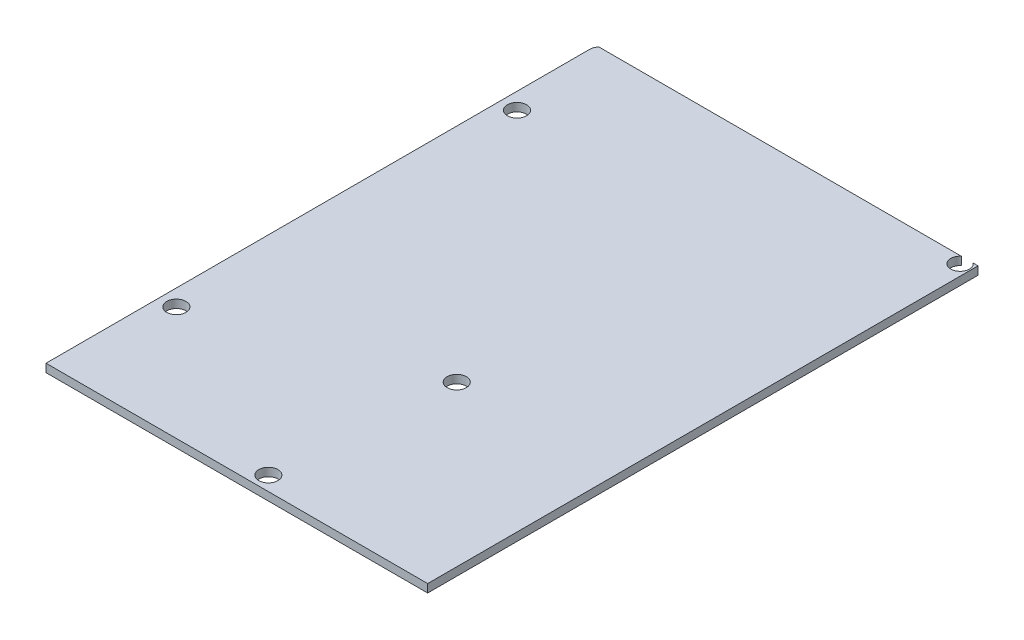
ISO-10303-21;
HEADER;
FILE_DESCRIPTION(('STEP AP214'),'2;1');
FILE_NAME('part.step','',(''),(''),'','','');
FILE_SCHEMA(('AUTOMOTIVE_DESIGN { 1 0 10303 214 1 1 1 1 }'));
ENDSEC;
DATA;
#1=APPLICATION_CONTEXT('core data for automotive mechanical design processes');
#2=APPLICATION_PROTOCOL_DEFINITION('international standard','automotive_design',2000,#1);
#3=PRODUCT_CONTEXT('',#1,'mechanical');
#4=PRODUCT('Part','Part','',(#3));
#5=PRODUCT_RELATED_PRODUCT_CATEGORY('part','',(#4));
#6=PRODUCT_DEFINITION_FORMATION('','',#4);
#7=PRODUCT_DEFINITION_CONTEXT('part definition',#1,'design');
#8=PRODUCT_DEFINITION('design','',#6,#7);
#9=PRODUCT_DEFINITION_SHAPE('','',#8);
#10=(LENGTH_UNIT() NAMED_UNIT(*) SI_UNIT(.MILLI.,.METRE.));
#11=(NAMED_UNIT(*) PLANE_ANGLE_UNIT() SI_UNIT($,.RADIAN.));
#12=(NAMED_UNIT(*) SI_UNIT($,.STERADIAN.) SOLID_ANGLE_UNIT());
#13=UNCERTAINTY_MEASURE_WITH_UNIT(LENGTH_MEASURE(1.E-05),#10,'distance_accuracy_value','');
#14=(GEOMETRIC_REPRESENTATION_CONTEXT(3) GLOBAL_UNCERTAINTY_ASSIGNED_CONTEXT((#13)) GLOBAL_UNIT_ASSIGNED_CONTEXT((#10,
#11,#12)) REPRESENTATION_CONTEXT('',''));
#15=CARTESIAN_POINT('',(0.,0.,0.));
#16=DIRECTION('',(0.,0.,1.));
#17=DIRECTION('',(1.,0.,0.));
#18=AXIS2_PLACEMENT_3D('',#15,#16,#17);
#19=CARTESIAN_POINT('',(-2.655,1.5,-0.520482398309197));
#20=DIRECTION('',(0.,1.,0.));
#21=DIRECTION('',(1.,0.,0.));
#22=AXIS2_PLACEMENT_3D('',#19,#20,#21);
#23=PLANE('',#22);
#24=CARTESIAN_POINT('',(-39.6,1.5,27.8));
#25=DIRECTION('',(0.,-1.,0.));
#26=DIRECTION('',(1.,0.,0.));
#27=AXIS2_PLACEMENT_3D('',#24,#25,#26);
#28=CIRCLE('',#27,1.75);
#29=CARTESIAN_POINT('',(-37.85,1.5,27.8));
#30=VERTEX_POINT('',#29);
#31=CARTESIAN_POINT('',(-41.35,1.5,27.8));
#32=VERTEX_POINT('',#31);
#33=EDGE_CURVE('E205',#30,#32,#28,.T.);
#34=ORIENTED_EDGE('',*,*,#33,.T.);
#35=CARTESIAN_POINT('',(-39.6,1.5,27.8));
#36=DIRECTION('',(0.,-1.,0.));
#37=DIRECTION('',(1.,0.,0.));
#38=AXIS2_PLACEMENT_3D('',#35,#36,#37);
#39=CIRCLE('',#38,1.75);
#40=EDGE_CURVE('E226',#32,#30,#39,.T.);
#41=ORIENTED_EDGE('',*,*,#40,.T.);
#42=EDGE_LOOP('',(#34,#41));
#43=FACE_BOUND('',#42,.T.);
#44=CARTESIAN_POINT('',(-2.1,1.5,14.1));
#45=DIRECTION('',(0.,-1.,0.));
#46=DIRECTION('',(1.,0.,0.));
#47=AXIS2_PLACEMENT_3D('',#44,#45,#46);
#48=CIRCLE('',#47,1.75);
#49=CARTESIAN_POINT('',(-0.350000000000008,1.5,14.1));
#50=VERTEX_POINT('',#49);
#51=CARTESIAN_POINT('',(-3.85,1.5,14.1));
#52=VERTEX_POINT('',#51);
#53=EDGE_CURVE('E225',#50,#52,#48,.T.);
#54=ORIENTED_EDGE('',*,*,#53,.T.);
#55=CARTESIAN_POINT('',(-2.1,1.5,14.1));
#56=DIRECTION('',(0.,-1.,0.));
#57=DIRECTION('',(1.,0.,0.));
#58=AXIS2_PLACEMENT_3D('',#55,#56,#57);
#59=CIRCLE('',#58,1.75);
#60=EDGE_CURVE('E230',#52,#50,#59,.T.);
#61=ORIENTED_EDGE('',*,*,#60,.T.);
#62=EDGE_LOOP('',(#54,#61));
#63=FACE_BOUND('',#62,.T.);
#64=CARTESIAN_POINT('',(-39.6,1.5,-34.4));
#65=DIRECTION('',(0.,-1.,0.));
#66=DIRECTION('',(1.,0.,0.));
#67=AXIS2_PLACEMENT_3D('',#64,#65,#66);
#68=CIRCLE('',#67,1.75);
#69=CARTESIAN_POINT('',(-37.85,1.5,-34.4));
#70=VERTEX_POINT('',#69);
#71=CARTESIAN_POINT('',(-41.35,1.5,-34.4));
#72=VERTEX_POINT('',#71);
#73=EDGE_CURVE('E161',#70,#72,#68,.T.);
#74=ORIENTED_EDGE('',*,*,#73,.T.);
#75=CARTESIAN_POINT('',(-39.6,1.5,-34.4));
#76=DIRECTION('',(0.,-1.,0.));
#77=DIRECTION('',(1.,0.,0.));
#78=AXIS2_PLACEMENT_3D('',#75,#76,#77);
#79=CIRCLE('',#78,1.75);
#80=EDGE_CURVE('E165',#72,#70,#79,.T.);
#81=ORIENTED_EDGE('',*,*,#80,.T.);
#82=EDGE_LOOP('',(#74,#81));
#83=FACE_BOUND('',#82,.T.);
#84=CARTESIAN_POINT('',(-4.6,1.5,46.));
#85=DIRECTION('',(0.,-1.,0.));
#86=DIRECTION('',(1.,0.,0.));
#87=AXIS2_PLACEMENT_3D('',#84,#85,#86);
#88=CIRCLE('',#87,1.75);
#89=CARTESIAN_POINT('',(-2.85,1.5,46.));
#90=VERTEX_POINT('',#89);
#91=CARTESIAN_POINT('',(-6.35,1.5,46.));
#92=VERTEX_POINT('',#91);
#93=EDGE_CURVE('E219',#90,#92,#88,.T.);
#94=ORIENTED_EDGE('',*,*,#93,.T.);
#95=CARTESIAN_POINT('',(-4.6,1.5,46.));
#96=DIRECTION('',(0.,-1.,0.));
#97=DIRECTION('',(1.,0.,0.));
#98=AXIS2_PLACEMENT_3D('',#95,#96,#97);
#99=CIRCLE('',#98,1.75);
#100=EDGE_CURVE('E215',#92,#90,#99,.T.);
#101=ORIENTED_EDGE('',*,*,#100,.T.);
#102=EDGE_LOOP('',(#94,#101));
#103=FACE_BOUND('',#102,.T.);
#104=CARTESIAN_POINT('',(25.1353213902922,1.5,-50.5909647966184));
#105=DIRECTION('',(0.,-1.,0.));
#106=DIRECTION('',(1.,0.,0.));
#107=AXIS2_PLACEMENT_3D('',#104,#105,#106);
#108=CIRCLE('',#107,1.7);
#109=CARTESIAN_POINT('',(26.2287993093726,1.49999995944139,-51.8926199124165));
#110=VERTEX_POINT('',#109);
#111=CARTESIAN_POINT('',(24.0418434712117,1.49999995944139,-51.8926199124165));
#112=VERTEX_POINT('',#111);
#113=EDGE_CURVE('E206',#110,#112,#108,.T.);
#114=ORIENTED_EDGE('',*,*,#113,.T.);
#115=DIRECTION('',(-1.,0.,0.));
#116=VECTOR('',#115,1.);
#117=CARTESIAN_POINT('',(-21.0630749900934,1.5,-51.8926199124165));
#118=LINE('',#117,#116);
#119=CARTESIAN_POINT('',(-42.1261499801869,1.49999995944139,-51.8926199124165));
#120=VERTEX_POINT('',#119);
#121=EDGE_CURVE('E134',#112,#120,#118,.T.);
#122=ORIENTED_EDGE('',*,*,#121,.T.);
#123=CARTESIAN_POINT('',(-40.6,1.5,-50.6));
#124=DIRECTION('',(0.,-1.,0.));
#125=DIRECTION('',(-0.707106781186548,0.,-0.707106781186548));
#126=AXIS2_PLACEMENT_3D('',#123,#124,#125);
#127=CIRCLE('',#126,2.);
#128=CARTESIAN_POINT('',(-42.6,1.5,-50.6));
#129=VERTEX_POINT('',#128);
#130=EDGE_CURVE('E131',#129,#120,#127,.T.);
#131=ORIENTED_EDGE('',*,*,#130,.F.);
#132=DIRECTION('',(0.,0.,1.));
#133=VECTOR('',#132,1.);
#134=CARTESIAN_POINT('',(-42.6,1.5,-52.6));
#135=LINE('',#134,#133);
#136=CARTESIAN_POINT('',(-42.6,1.49999995944139,48.6073800875835));
#137=VERTEX_POINT('',#136);
#138=EDGE_CURVE('E119',#129,#137,#135,.T.);
#139=ORIENTED_EDGE('',*,*,#138,.T.);
#140=DIRECTION('',(-1.,0.,0.));
#141=VECTOR('',#140,1.);
#142=CARTESIAN_POINT('',(-42.9,1.49999995944139,48.6073800875835));
#143=LINE('',#142,#141);
#144=CARTESIAN_POINT('',(27.1,1.49999995944139,48.6073800875835));
#145=VERTEX_POINT('',#144);
#146=EDGE_CURVE('E11',#145,#137,#143,.T.);
#147=ORIENTED_EDGE('',*,*,#146,.F.);
#148=DIRECTION('',(0.,0.,1.));
#149=VECTOR('',#148,1.);
#150=CARTESIAN_POINT('',(27.1,1.49999995944139,48.6073800875835));
#151=LINE('',#150,#149);
#152=CARTESIAN_POINT('',(27.1,1.49999995944139,-51.8926199124165));
#153=VERTEX_POINT('',#152);
#154=EDGE_CURVE('E211',#153,#145,#151,.T.);
#155=ORIENTED_EDGE('',*,*,#154,.F.);
#156=DIRECTION('',(-1.,0.,0.));
#157=VECTOR('',#156,1.);
#158=CARTESIAN_POINT('',(13.1143996546863,1.5,-51.8926199124165));
#159=LINE('',#158,#157);
#160=EDGE_CURVE('E154',#153,#110,#159,.T.);
#161=ORIENTED_EDGE('',*,*,#160,.T.);
#162=EDGE_LOOP('',(#114,#122,#131,#139,#147,#155,#161));
#163=FACE_BOUND('',#162,.T.);
#164=ADVANCED_FACE('F16',(#43,#63,#83,#103,#163),#23,.T.);
#165=CARTESIAN_POINT('',(27.1,4.05586098040089E-08,48.6073800875835));
#166=DIRECTION('',(0.,0.,-1.));
#167=DIRECTION('',(0.,-1.,0.));
#168=AXIS2_PLACEMENT_3D('',#165,#166,#167);
#169=PLANE('',#168);
#170=DIRECTION('',(-1.,0.,0.));
#171=VECTOR('',#170,1.);
#172=CARTESIAN_POINT('',(13.55,0.,48.6073800875835));
#173=LINE('',#172,#171);
#174=CARTESIAN_POINT('',(27.1,4.05586098040089E-08,48.6073800875835));
#175=VERTEX_POINT('',#174);
#176=CARTESIAN_POINT('',(-42.6,4.05586098040089E-08,48.6073800875835));
#177=VERTEX_POINT('',#176);
#178=EDGE_CURVE('E20',#175,#177,#173,.T.);
#179=ORIENTED_EDGE('',*,*,#178,.F.);
#180=DIRECTION('',(0.,1.,0.));
#181=VECTOR('',#180,1.);
#182=CARTESIAN_POINT('',(27.1,4.05586098040089E-08,48.6073800875835));
#183=LINE('',#182,#181);
#184=EDGE_CURVE('E27',#175,#145,#183,.T.);
#185=ORIENTED_EDGE('',*,*,#184,.T.);
#186=ORIENTED_EDGE('',*,*,#146,.T.);
#187=DIRECTION('',(0.,1.,0.));
#188=VECTOR('',#187,1.);
#189=CARTESIAN_POINT('',(-42.6,2.02793049020045E-08,48.6073800875835));
#190=LINE('',#189,#188);
#191=EDGE_CURVE('E126',#177,#137,#190,.T.);
#192=ORIENTED_EDGE('',*,*,#191,.F.);
#193=EDGE_LOOP('',(#179,#185,#186,#192));
#194=FACE_BOUND('',#193,.T.);
#195=ADVANCED_FACE('F321',(#194),#169,.F.);
#196=CARTESIAN_POINT('',(27.1,4.05586098040089E-08,-51.8926199124165));
#197=DIRECTION('',(-1.,0.,0.));
#198=DIRECTION('',(0.,0.,1.));
#199=AXIS2_PLACEMENT_3D('',#196,#197,#198);
#200=PLANE('',#199);
#201=DIRECTION('',(0.,0.,1.));
#202=VECTOR('',#201,1.);
#203=CARTESIAN_POINT('',(27.1,0.,-25.9463099562083));
#204=LINE('',#203,#202);
#205=CARTESIAN_POINT('',(27.1,4.05586098040089E-08,-51.8926199124165));
#206=VERTEX_POINT('',#205);
#207=EDGE_CURVE('E170',#206,#175,#204,.T.);
#208=ORIENTED_EDGE('',*,*,#207,.F.);
#209=DIRECTION('',(0.,1.,0.));
#210=VECTOR('',#209,1.);
#211=CARTESIAN_POINT('',(27.1,4.05586098040089E-08,-51.8926199124165));
#212=LINE('',#211,#210);
#213=EDGE_CURVE('E156',#206,#153,#212,.T.);
#214=ORIENTED_EDGE('',*,*,#213,.T.);
#215=ORIENTED_EDGE('',*,*,#154,.T.);
#216=ORIENTED_EDGE('',*,*,#184,.F.);
#217=EDGE_LOOP('',(#208,#214,#215,#216));
#218=FACE_BOUND('',#217,.T.);
#219=ADVANCED_FACE('F276',(#218),#200,.F.);
#220=CARTESIAN_POINT('',(26.2287993093726,4.05586098040089E-08,-51.8926199124165));
#221=DIRECTION('',(0.,0.,1.));
#222=DIRECTION('',(1.,0.,0.));
#223=AXIS2_PLACEMENT_3D('',#220,#221,#222);
#224=PLANE('',#223);
#225=DIRECTION('',(1.,0.,0.));
#226=VECTOR('',#225,1.);
#227=CARTESIAN_POINT('',(13.1143996546863,0.,-51.8926199124165));
#228=LINE('',#227,#226);
#229=CARTESIAN_POINT('',(26.2287993093726,4.05586098040089E-08,-51.8926199124165));
#230=VERTEX_POINT('',#229);
#231=EDGE_CURVE('E166',#230,#206,#228,.T.);
#232=ORIENTED_EDGE('',*,*,#231,.F.);
#233=DIRECTION('',(0.,1.,0.));
#234=VECTOR('',#233,1.);
#235=CARTESIAN_POINT('',(26.2287993093726,4.05586098040089E-08,-51.8926199124165));
#236=LINE('',#235,#234);
#237=EDGE_CURVE('E209',#230,#110,#236,.T.);
#238=ORIENTED_EDGE('',*,*,#237,.T.);
#239=ORIENTED_EDGE('',*,*,#160,.F.);
#240=ORIENTED_EDGE('',*,*,#213,.F.);
#241=EDGE_LOOP('',(#232,#238,#239,#240));
#242=FACE_BOUND('',#241,.T.);
#243=ADVANCED_FACE('F278',(#242),#224,.F.);
#244=CARTESIAN_POINT('',(-42.1261499801868,4.05586098040089E-08,-51.8926199124165));
#245=DIRECTION('',(0.,0.,1.));
#246=DIRECTION('',(1.,0.,0.));
#247=AXIS2_PLACEMENT_3D('',#244,#245,#246);
#248=PLANE('',#247);
#249=DIRECTION('',(1.,0.,0.));
#250=VECTOR('',#249,1.);
#251=CARTESIAN_POINT('',(-21.0630749900934,0.,-51.8926199124165));
#252=LINE('',#251,#250);
#253=CARTESIAN_POINT('',(-42.1261499801869,4.05586098040089E-08,-51.8926199124165));
#254=VERTEX_POINT('',#253);
#255=CARTESIAN_POINT('',(24.0418434712117,4.05586098040089E-08,-51.8926199124165));
#256=VERTEX_POINT('',#255);
#257=EDGE_CURVE('E174',#254,#256,#252,.T.);
#258=ORIENTED_EDGE('',*,*,#257,.F.);
#259=DIRECTION('',(0.,-1.,0.));
#260=VECTOR('',#259,1.);
#261=CARTESIAN_POINT('',(-42.1261499801869,0.,-51.8926199124165));
#262=LINE('',#261,#260);
#263=EDGE_CURVE('E143',#120,#254,#262,.T.);
#264=ORIENTED_EDGE('',*,*,#263,.F.);
#265=ORIENTED_EDGE('',*,*,#121,.F.);
#266=DIRECTION('',(0.,1.,0.));
#267=VECTOR('',#266,1.);
#268=CARTESIAN_POINT('',(24.0418434712117,4.05586098040089E-08,-51.8926199124165));
#269=LINE('',#268,#267);
#270=EDGE_CURVE('E210',#256,#112,#269,.T.);
#271=ORIENTED_EDGE('',*,*,#270,.F.);
#272=EDGE_LOOP('',(#258,#264,#265,#271));
#273=FACE_BOUND('',#272,.T.);
#274=ADVANCED_FACE('F287',(#273),#248,.F.);
#275=CARTESIAN_POINT('',(-4.6,-133.882162783729,46.));
#276=DIRECTION('',(0.,1.,0.));
#277=DIRECTION('',(1.,0.,0.));
#278=AXIS2_PLACEMENT_3D('',#275,#276,#277);
#279=CYLINDRICAL_SURFACE('',#278,1.75);
#280=CARTESIAN_POINT('',(-4.6,0.,46.));
#281=DIRECTION('',(0.,1.,0.));
#282=DIRECTION('',(1.,0.,0.));
#283=AXIS2_PLACEMENT_3D('',#280,#281,#282);
#284=CIRCLE('',#283,1.75);
#285=CARTESIAN_POINT('',(-6.35,0.,46.));
#286=VERTEX_POINT('',#285);
#287=EDGE_CURVE('E177',#286,#286,#284,.T.);
#288=ORIENTED_EDGE('',*,*,#287,.F.);
#289=DIRECTION('',(0.,1.,0.));
#290=VECTOR('',#289,1.);
#291=CARTESIAN_POINT('',(-6.35,-133.882162783729,46.));
#292=LINE('',#291,#290);
#293=EDGE_CURVE('E173',#286,#92,#292,.T.);
#294=ORIENTED_EDGE('',*,*,#293,.T.);
#295=ORIENTED_EDGE('',*,*,#93,.F.);
#296=ORIENTED_EDGE('',*,*,#100,.F.);
#297=ORIENTED_EDGE('',*,*,#293,.F.);
#298=EDGE_LOOP('',(#288,#294,#295,#296,#297));
#299=FACE_BOUND('',#298,.T.);
#300=ADVANCED_FACE('F333',(#299),#279,.F.);
#301=CARTESIAN_POINT('',(-39.6,-133.882162783729,-34.4));
#302=DIRECTION('',(0.,1.,0.));
#303=DIRECTION('',(1.,0.,0.));
#304=AXIS2_PLACEMENT_3D('',#301,#302,#303);
#305=CYLINDRICAL_SURFACE('',#304,1.75);
#306=CARTESIAN_POINT('',(-39.6,0.,-34.4));
#307=DIRECTION('',(0.,1.,0.));
#308=DIRECTION('',(1.,0.,0.));
#309=AXIS2_PLACEMENT_3D('',#306,#307,#308);
#310=CIRCLE('',#309,1.75);
#311=CARTESIAN_POINT('',(-41.35,0.,-34.4));
#312=VERTEX_POINT('',#311);
#313=EDGE_CURVE('E187',#312,#312,#310,.T.);
#314=ORIENTED_EDGE('',*,*,#313,.F.);
#315=DIRECTION('',(0.,1.,0.));
#316=VECTOR('',#315,1.);
#317=CARTESIAN_POINT('',(-41.35,-133.882162783729,-34.4));
#318=LINE('',#317,#316);
#319=EDGE_CURVE('E153',#312,#72,#318,.T.);
#320=ORIENTED_EDGE('',*,*,#319,.T.);
#321=ORIENTED_EDGE('',*,*,#73,.F.);
#322=ORIENTED_EDGE('',*,*,#80,.F.);
#323=ORIENTED_EDGE('',*,*,#319,.F.);
#324=EDGE_LOOP('',(#314,#320,#321,#322,#323));
#325=FACE_BOUND('',#324,.T.);
#326=ADVANCED_FACE('F303',(#325),#305,.F.);
#327=CARTESIAN_POINT('',(-2.1,-133.882162783729,14.1));
#328=DIRECTION('',(0.,1.,0.));
#329=DIRECTION('',(1.,0.,0.));
#330=AXIS2_PLACEMENT_3D('',#327,#328,#329);
#331=CYLINDRICAL_SURFACE('',#330,1.75);
#332=CARTESIAN_POINT('',(-2.1,0.,14.1));
#333=DIRECTION('',(0.,1.,0.));
#334=DIRECTION('',(1.,0.,0.));
#335=AXIS2_PLACEMENT_3D('',#332,#333,#334);
#336=CIRCLE('',#335,1.75);
#337=CARTESIAN_POINT('',(-3.85,0.,14.1));
#338=VERTEX_POINT('',#337);
#339=EDGE_CURVE('E160',#338,#338,#336,.T.);
#340=ORIENTED_EDGE('',*,*,#339,.F.);
#341=DIRECTION('',(0.,1.,0.));
#342=VECTOR('',#341,1.);
#343=CARTESIAN_POINT('',(-3.85,-133.882162783729,14.1));
#344=LINE('',#343,#342);
#345=EDGE_CURVE('E222',#338,#52,#344,.T.);
#346=ORIENTED_EDGE('',*,*,#345,.T.);
#347=ORIENTED_EDGE('',*,*,#53,.F.);
#348=ORIENTED_EDGE('',*,*,#60,.F.);
#349=ORIENTED_EDGE('',*,*,#345,.F.);
#350=EDGE_LOOP('',(#340,#346,#347,#348,#349));
#351=FACE_BOUND('',#350,.T.);
#352=ADVANCED_FACE('F391',(#351),#331,.F.);
#353=CARTESIAN_POINT('',(-39.6,-133.882162783729,27.8));
#354=DIRECTION('',(0.,1.,0.));
#355=DIRECTION('',(1.,0.,0.));
#356=AXIS2_PLACEMENT_3D('',#353,#354,#355);
#357=CYLINDRICAL_SURFACE('',#356,1.75);
#358=CARTESIAN_POINT('',(-39.6,0.,27.8));
#359=DIRECTION('',(0.,1.,0.));
#360=DIRECTION('',(1.,0.,0.));
#361=AXIS2_PLACEMENT_3D('',#358,#359,#360);
#362=CIRCLE('',#361,1.75);
#363=CARTESIAN_POINT('',(-41.35,0.,27.8));
#364=VERTEX_POINT('',#363);
#365=EDGE_CURVE('E149',#364,#364,#362,.T.);
#366=ORIENTED_EDGE('',*,*,#365,.F.);
#367=DIRECTION('',(0.,1.,0.));
#368=VECTOR('',#367,1.);
#369=CARTESIAN_POINT('',(-41.35,-133.882162783729,27.8));
#370=LINE('',#369,#368);
#371=EDGE_CURVE('E128',#364,#32,#370,.T.);
#372=ORIENTED_EDGE('',*,*,#371,.T.);
#373=ORIENTED_EDGE('',*,*,#33,.F.);
#374=ORIENTED_EDGE('',*,*,#40,.F.);
#375=ORIENTED_EDGE('',*,*,#371,.F.);
#376=EDGE_LOOP('',(#366,#372,#373,#374,#375));
#377=FACE_BOUND('',#376,.T.);
#378=ADVANCED_FACE('F386',(#377),#357,.F.);
#379=CARTESIAN_POINT('',(-42.6,0.,-52.6));
#380=DIRECTION('',(-1.,0.,0.));
#381=DIRECTION('',(0.,0.,1.));
#382=AXIS2_PLACEMENT_3D('',#379,#380,#381);
#383=PLANE('',#382);
#384=ORIENTED_EDGE('',*,*,#191,.T.);
#385=ORIENTED_EDGE('',*,*,#138,.F.);
#386=DIRECTION('',(0.,1.,0.));
#387=VECTOR('',#386,1.);
#388=CARTESIAN_POINT('',(-42.6,0.,-50.6));
#389=LINE('',#388,#387);
#390=CARTESIAN_POINT('',(-42.6,0.,-50.6));
#391=VERTEX_POINT('',#390);
#392=EDGE_CURVE('E124',#391,#129,#389,.T.);
#393=ORIENTED_EDGE('',*,*,#392,.F.);
#394=DIRECTION('',(0.,0.,1.));
#395=VECTOR('',#394,1.);
#396=CARTESIAN_POINT('',(-42.6,0.,-52.6));
#397=LINE('',#396,#395);
#398=EDGE_CURVE('E190',#391,#177,#397,.T.);
#399=ORIENTED_EDGE('',*,*,#398,.T.);
#400=EDGE_LOOP('',(#384,#385,#393,#399));
#401=FACE_BOUND('',#400,.T.);
#402=ADVANCED_FACE('F121',(#401),#383,.T.);
#403=CARTESIAN_POINT('',(-40.6,0.,-50.6));
#404=DIRECTION('',(0.,1.,0.));
#405=DIRECTION('',(-0.707106781186548,0.,-0.707106781186548));
#406=AXIS2_PLACEMENT_3D('',#403,#404,#405);
#407=CYLINDRICAL_SURFACE('',#406,2.);
#408=ORIENTED_EDGE('',*,*,#263,.T.);
#409=CARTESIAN_POINT('',(-40.6,0.,-50.6));
#410=DIRECTION('',(0.,1.,0.));
#411=DIRECTION('',(-0.707106781186548,0.,-0.707106781186548));
#412=AXIS2_PLACEMENT_3D('',#409,#410,#411);
#413=CIRCLE('',#412,2.);
#414=EDGE_CURVE('E140',#254,#391,#413,.T.);
#415=ORIENTED_EDGE('',*,*,#414,.T.);
#416=ORIENTED_EDGE('',*,*,#392,.T.);
#417=ORIENTED_EDGE('',*,*,#130,.T.);
#418=EDGE_LOOP('',(#408,#415,#416,#417));
#419=FACE_BOUND('',#418,.T.);
#420=ADVANCED_FACE('F18',(#419),#407,.T.);
#421=CARTESIAN_POINT('',(0.,0.,0.));
#422=DIRECTION('',(0.,1.,0.));
#423=DIRECTION('',(1.,0.,0.));
#424=AXIS2_PLACEMENT_3D('',#421,#422,#423);
#425=PLANE('',#424);
#426=ORIENTED_EDGE('',*,*,#365,.T.);
#427=EDGE_LOOP('',(#426));
#428=FACE_BOUND('',#427,.T.);
#429=ORIENTED_EDGE('',*,*,#339,.T.);
#430=EDGE_LOOP('',(#429));
#431=FACE_BOUND('',#430,.T.);
#432=ORIENTED_EDGE('',*,*,#313,.T.);
#433=EDGE_LOOP('',(#432));
#434=FACE_BOUND('',#433,.T.);
#435=ORIENTED_EDGE('',*,*,#287,.T.);
#436=EDGE_LOOP('',(#435));
#437=FACE_BOUND('',#436,.T.);
#438=CARTESIAN_POINT('',(25.1353213902922,0.,-50.5909647966184));
#439=DIRECTION('',(0.,1.,0.));
#440=DIRECTION('',(1.,0.,0.));
#441=AXIS2_PLACEMENT_3D('',#438,#439,#440);
#442=CIRCLE('',#441,1.7);
#443=EDGE_CURVE('E171',#256,#230,#442,.T.);
#444=ORIENTED_EDGE('',*,*,#443,.T.);
#445=ORIENTED_EDGE('',*,*,#231,.T.);
#446=ORIENTED_EDGE('',*,*,#207,.T.);
#447=ORIENTED_EDGE('',*,*,#178,.T.);
#448=ORIENTED_EDGE('',*,*,#398,.F.);
#449=ORIENTED_EDGE('',*,*,#414,.F.);
#450=ORIENTED_EDGE('',*,*,#257,.T.);
#451=EDGE_LOOP('',(#444,#445,#446,#447,#448,#449,#450));
#452=FACE_BOUND('',#451,.T.);
#453=ADVANCED_FACE('F306',(#428,#431,#434,#437,#452),#425,.F.);
#454=CARTESIAN_POINT('',(25.1353213902922,4.05586098040089E-08,-50.5909647966184));
#455=DIRECTION('',(0.,1.,0.));
#456=DIRECTION('',(0.,0.,1.));
#457=AXIS2_PLACEMENT_3D('',#454,#455,#456);
#458=CYLINDRICAL_SURFACE('',#457,1.7);
#459=ORIENTED_EDGE('',*,*,#270,.T.);
#460=ORIENTED_EDGE('',*,*,#113,.F.);
#461=ORIENTED_EDGE('',*,*,#237,.F.);
#462=ORIENTED_EDGE('',*,*,#443,.F.);
#463=EDGE_LOOP('',(#459,#460,#461,#462));
#464=FACE_BOUND('',#463,.T.);
#465=ADVANCED_FACE('F285',(#464),#458,.F.);
#466=CLOSED_SHELL('',(#164,#195,#219,#243,#274,#300,#326,#352,#378,#402,#420,#453,#465));
#467=MANIFOLD_SOLID_BREP('B1',#466);
#468=ADVANCED_BREP_SHAPE_REPRESENTATION('',(#18,#467),#14);
#469=SHAPE_DEFINITION_REPRESENTATION(#9,#468);
ENDSEC;
END-ISO-10303-21;
